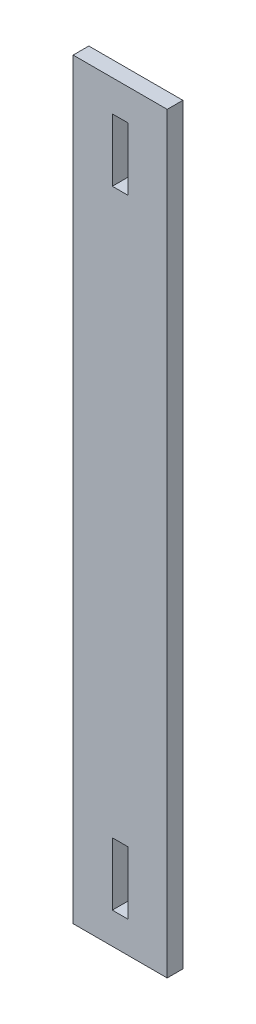
ISO-10303-21;
HEADER;
FILE_DESCRIPTION(('STEP AP214'),'2;1');
FILE_NAME('part.step','',(''),(''),'','','');
FILE_SCHEMA(('AUTOMOTIVE_DESIGN { 1 0 10303 214 1 1 1 1 }'));
ENDSEC;
DATA;
#1=APPLICATION_CONTEXT('core data for automotive mechanical design processes');
#2=APPLICATION_PROTOCOL_DEFINITION('international standard','automotive_design',2000,#1);
#3=PRODUCT_CONTEXT('',#1,'mechanical');
#4=PRODUCT('Part','Part','',(#3));
#5=PRODUCT_RELATED_PRODUCT_CATEGORY('part','',(#4));
#6=PRODUCT_DEFINITION_FORMATION('','',#4);
#7=PRODUCT_DEFINITION_CONTEXT('part definition',#1,'design');
#8=PRODUCT_DEFINITION('design','',#6,#7);
#9=PRODUCT_DEFINITION_SHAPE('','',#8);
#10=(LENGTH_UNIT() NAMED_UNIT(*) SI_UNIT(.MILLI.,.METRE.));
#11=(NAMED_UNIT(*) PLANE_ANGLE_UNIT() SI_UNIT($,.RADIAN.));
#12=(NAMED_UNIT(*) SI_UNIT($,.STERADIAN.) SOLID_ANGLE_UNIT());
#13=UNCERTAINTY_MEASURE_WITH_UNIT(LENGTH_MEASURE(1.E-05),#10,'distance_accuracy_value','');
#14=(GEOMETRIC_REPRESENTATION_CONTEXT(3) GLOBAL_UNCERTAINTY_ASSIGNED_CONTEXT((#13)) GLOBAL_UNIT_ASSIGNED_CONTEXT((#10,
#11,#12)) REPRESENTATION_CONTEXT('',''));
#15=CARTESIAN_POINT('',(0.,0.,0.));
#16=DIRECTION('',(0.,0.,1.));
#17=DIRECTION('',(1.,0.,0.));
#18=AXIS2_PLACEMENT_3D('',#15,#16,#17);
#19=CARTESIAN_POINT('',(0.,0.,6.35));
#20=DIRECTION('',(0.,0.,-1.));
#21=DIRECTION('',(-1.,0.,0.));
#22=AXIS2_PLACEMENT_3D('',#19,#20,#21);
#23=PLANE('',#22);
#24=DIRECTION('',(0.,1.,0.));
#25=VECTOR('',#24,1.);
#26=CARTESIAN_POINT('',(19.05,-152.4,6.35));
#27=LINE('',#26,#25);
#28=CARTESIAN_POINT('',(19.05,-152.4,6.35));
#29=VERTEX_POINT('',#28);
#30=CARTESIAN_POINT('',(19.05,152.4,6.35));
#31=VERTEX_POINT('',#30);
#32=EDGE_CURVE('E193',#29,#31,#27,.T.);
#33=ORIENTED_EDGE('',*,*,#32,.T.);
#34=DIRECTION('',(-1.,0.,0.));
#35=VECTOR('',#34,1.);
#36=CARTESIAN_POINT('',(-19.05,152.4,6.35));
#37=LINE('',#36,#35);
#38=CARTESIAN_POINT('',(-19.05,152.4,6.35));
#39=VERTEX_POINT('',#38);
#40=EDGE_CURVE('E197',#31,#39,#37,.T.);
#41=ORIENTED_EDGE('',*,*,#40,.T.);
#42=DIRECTION('',(0.,-1.,0.));
#43=VECTOR('',#42,1.);
#44=CARTESIAN_POINT('',(-19.05,-152.4,6.35));
#45=LINE('',#44,#43);
#46=CARTESIAN_POINT('',(-19.05,-152.4,6.35));
#47=VERTEX_POINT('',#46);
#48=EDGE_CURVE('E200',#39,#47,#45,.T.);
#49=ORIENTED_EDGE('',*,*,#48,.T.);
#50=DIRECTION('',(1.,0.,0.));
#51=VECTOR('',#50,1.);
#52=CARTESIAN_POINT('',(-19.05,-152.4,6.35));
#53=LINE('',#52,#51);
#54=EDGE_CURVE('E202',#47,#29,#53,.T.);
#55=ORIENTED_EDGE('',*,*,#54,.T.);
#56=EDGE_LOOP('',(#33,#41,#49,#55));
#57=FACE_BOUND('',#56,.T.);
#58=DIRECTION('',(-1.,0.,0.));
#59=VECTOR('',#58,1.);
#60=CARTESIAN_POINT('',(-3.175,139.7,6.35));
#61=LINE('',#60,#59);
#62=CARTESIAN_POINT('',(3.175,139.7,6.35));
#63=VERTEX_POINT('',#62);
#64=CARTESIAN_POINT('',(-3.175,139.7,6.35));
#65=VERTEX_POINT('',#64);
#66=EDGE_CURVE('E176',#63,#65,#61,.T.);
#67=ORIENTED_EDGE('',*,*,#66,.F.);
#68=DIRECTION('',(0.,1.,0.));
#69=VECTOR('',#68,1.);
#70=CARTESIAN_POINT('',(3.175,114.3,6.35));
#71=LINE('',#70,#69);
#72=CARTESIAN_POINT('',(3.175,114.3,6.35));
#73=VERTEX_POINT('',#72);
#74=EDGE_CURVE('E157',#73,#63,#71,.T.);
#75=ORIENTED_EDGE('',*,*,#74,.F.);
#76=DIRECTION('',(1.,0.,0.));
#77=VECTOR('',#76,1.);
#78=CARTESIAN_POINT('',(-3.175,114.3,6.35));
#79=LINE('',#78,#77);
#80=CARTESIAN_POINT('',(-3.175,114.3,6.35));
#81=VERTEX_POINT('',#80);
#82=EDGE_CURVE('E165',#81,#73,#79,.T.);
#83=ORIENTED_EDGE('',*,*,#82,.F.);
#84=DIRECTION('',(0.,-1.,0.));
#85=VECTOR('',#84,1.);
#86=CARTESIAN_POINT('',(-3.175,114.3,6.35));
#87=LINE('',#86,#85);
#88=EDGE_CURVE('E179',#65,#81,#87,.T.);
#89=ORIENTED_EDGE('',*,*,#88,.F.);
#90=EDGE_LOOP('',(#67,#75,#83,#89));
#91=FACE_BOUND('',#90,.T.);
#92=DIRECTION('',(0.,-1.,0.));
#93=VECTOR('',#92,1.);
#94=CARTESIAN_POINT('',(3.175,-114.3,6.35));
#95=LINE('',#94,#93);
#96=CARTESIAN_POINT('',(3.175,-114.3,6.35));
#97=VERTEX_POINT('',#96);
#98=CARTESIAN_POINT('',(3.175,-139.7,6.35));
#99=VERTEX_POINT('',#98);
#100=EDGE_CURVE('E52',#97,#99,#95,.T.);
#101=ORIENTED_EDGE('',*,*,#100,.T.);
#102=DIRECTION('',(-1.,0.,0.));
#103=VECTOR('',#102,1.);
#104=CARTESIAN_POINT('',(-3.175,-139.7,6.35));
#105=LINE('',#104,#103);
#106=CARTESIAN_POINT('',(-3.175,-139.7,6.35));
#107=VERTEX_POINT('',#106);
#108=EDGE_CURVE('E142',#99,#107,#105,.T.);
#109=ORIENTED_EDGE('',*,*,#108,.T.);
#110=DIRECTION('',(0.,1.,0.));
#111=VECTOR('',#110,1.);
#112=CARTESIAN_POINT('',(-3.175,-114.3,6.35));
#113=LINE('',#112,#111);
#114=CARTESIAN_POINT('',(-3.175,-114.3,6.35));
#115=VERTEX_POINT('',#114);
#116=EDGE_CURVE('E145',#107,#115,#113,.T.);
#117=ORIENTED_EDGE('',*,*,#116,.T.);
#118=DIRECTION('',(1.,0.,0.));
#119=VECTOR('',#118,1.);
#120=CARTESIAN_POINT('',(-3.175,-114.3,6.35));
#121=LINE('',#120,#119);
#122=EDGE_CURVE('E151',#115,#97,#121,.T.);
#123=ORIENTED_EDGE('',*,*,#122,.T.);
#124=EDGE_LOOP('',(#101,#109,#117,#123));
#125=FACE_BOUND('',#124,.T.);
#126=ADVANCED_FACE('F37',(#57,#91,#125),#23,.F.);
#127=CARTESIAN_POINT('',(0.,0.,0.));
#128=DIRECTION('',(0.,0.,-1.));
#129=DIRECTION('',(-1.,0.,0.));
#130=AXIS2_PLACEMENT_3D('',#127,#128,#129);
#131=PLANE('',#130);
#132=DIRECTION('',(0.,1.,0.));
#133=VECTOR('',#132,1.);
#134=CARTESIAN_POINT('',(19.05,-152.4,0.));
#135=LINE('',#134,#133);
#136=CARTESIAN_POINT('',(19.05,-152.4,0.));
#137=VERTEX_POINT('',#136);
#138=CARTESIAN_POINT('',(19.05,152.4,0.));
#139=VERTEX_POINT('',#138);
#140=EDGE_CURVE('E186',#137,#139,#135,.T.);
#141=ORIENTED_EDGE('',*,*,#140,.F.);
#142=DIRECTION('',(1.,0.,0.));
#143=VECTOR('',#142,1.);
#144=CARTESIAN_POINT('',(-19.05,-152.4,0.));
#145=LINE('',#144,#143);
#146=CARTESIAN_POINT('',(-19.05,-152.4,0.));
#147=VERTEX_POINT('',#146);
#148=EDGE_CURVE('E198',#147,#137,#145,.T.);
#149=ORIENTED_EDGE('',*,*,#148,.F.);
#150=DIRECTION('',(0.,-1.,0.));
#151=VECTOR('',#150,1.);
#152=CARTESIAN_POINT('',(-19.05,-152.4,0.));
#153=LINE('',#152,#151);
#154=CARTESIAN_POINT('',(-19.05,152.4,0.));
#155=VERTEX_POINT('',#154);
#156=EDGE_CURVE('E210',#155,#147,#153,.T.);
#157=ORIENTED_EDGE('',*,*,#156,.F.);
#158=DIRECTION('',(-1.,0.,0.));
#159=VECTOR('',#158,1.);
#160=CARTESIAN_POINT('',(-19.05,152.4,0.));
#161=LINE('',#160,#159);
#162=EDGE_CURVE('E208',#139,#155,#161,.T.);
#163=ORIENTED_EDGE('',*,*,#162,.F.);
#164=EDGE_LOOP('',(#141,#149,#157,#163));
#165=FACE_BOUND('',#164,.T.);
#166=DIRECTION('',(0.,1.,0.));
#167=VECTOR('',#166,1.);
#168=CARTESIAN_POINT('',(3.175,114.3,0.));
#169=LINE('',#168,#167);
#170=CARTESIAN_POINT('',(3.175,114.3,0.));
#171=VERTEX_POINT('',#170);
#172=CARTESIAN_POINT('',(3.175,139.7,0.));
#173=VERTEX_POINT('',#172);
#174=EDGE_CURVE('E161',#171,#173,#169,.T.);
#175=ORIENTED_EDGE('',*,*,#174,.T.);
#176=DIRECTION('',(-1.,0.,0.));
#177=VECTOR('',#176,1.);
#178=CARTESIAN_POINT('',(-3.175,139.7,0.));
#179=LINE('',#178,#177);
#180=CARTESIAN_POINT('',(-3.175,139.7,0.));
#181=VERTEX_POINT('',#180);
#182=EDGE_CURVE('E164',#173,#181,#179,.T.);
#183=ORIENTED_EDGE('',*,*,#182,.T.);
#184=DIRECTION('',(0.,-1.,0.));
#185=VECTOR('',#184,1.);
#186=CARTESIAN_POINT('',(-3.175,114.3,0.));
#187=LINE('',#186,#185);
#188=CARTESIAN_POINT('',(-3.175,114.3,0.));
#189=VERTEX_POINT('',#188);
#190=EDGE_CURVE('E168',#181,#189,#187,.T.);
#191=ORIENTED_EDGE('',*,*,#190,.T.);
#192=DIRECTION('',(1.,0.,0.));
#193=VECTOR('',#192,1.);
#194=CARTESIAN_POINT('',(-3.175,114.3,0.));
#195=LINE('',#194,#193);
#196=EDGE_CURVE('E171',#189,#171,#195,.T.);
#197=ORIENTED_EDGE('',*,*,#196,.T.);
#198=EDGE_LOOP('',(#175,#183,#191,#197));
#199=FACE_BOUND('',#198,.T.);
#200=DIRECTION('',(-1.,0.,0.));
#201=VECTOR('',#200,1.);
#202=CARTESIAN_POINT('',(-3.175,-139.7,0.));
#203=LINE('',#202,#201);
#204=CARTESIAN_POINT('',(3.175,-139.7,0.));
#205=VERTEX_POINT('',#204);
#206=CARTESIAN_POINT('',(-3.175,-139.7,0.));
#207=VERTEX_POINT('',#206);
#208=EDGE_CURVE('E138',#205,#207,#203,.T.);
#209=ORIENTED_EDGE('',*,*,#208,.F.);
#210=DIRECTION('',(0.,-1.,0.));
#211=VECTOR('',#210,1.);
#212=CARTESIAN_POINT('',(3.175,-114.3,0.));
#213=LINE('',#212,#211);
#214=CARTESIAN_POINT('',(3.175,-114.3,0.));
#215=VERTEX_POINT('',#214);
#216=EDGE_CURVE('E134',#215,#205,#213,.T.);
#217=ORIENTED_EDGE('',*,*,#216,.F.);
#218=DIRECTION('',(1.,0.,0.));
#219=VECTOR('',#218,1.);
#220=CARTESIAN_POINT('',(-3.175,-114.3,0.));
#221=LINE('',#220,#219);
#222=CARTESIAN_POINT('',(-3.175,-114.3,0.));
#223=VERTEX_POINT('',#222);
#224=EDGE_CURVE('E126',#223,#215,#221,.T.);
#225=ORIENTED_EDGE('',*,*,#224,.F.);
#226=DIRECTION('',(0.,1.,0.));
#227=VECTOR('',#226,1.);
#228=CARTESIAN_POINT('',(-3.175,-114.3,0.));
#229=LINE('',#228,#227);
#230=EDGE_CURVE('E133',#207,#223,#229,.T.);
#231=ORIENTED_EDGE('',*,*,#230,.F.);
#232=EDGE_LOOP('',(#209,#217,#225,#231));
#233=FACE_BOUND('',#232,.T.);
#234=ADVANCED_FACE('F141',(#165,#199,#233),#131,.T.);
#235=CARTESIAN_POINT('',(19.05,-152.4,6.35));
#236=DIRECTION('',(-1.,0.,0.));
#237=DIRECTION('',(0.,0.,1.));
#238=AXIS2_PLACEMENT_3D('',#235,#236,#237);
#239=PLANE('',#238);
#240=ORIENTED_EDGE('',*,*,#140,.T.);
#241=DIRECTION('',(0.,0.,-1.));
#242=VECTOR('',#241,1.);
#243=CARTESIAN_POINT('',(19.05,152.4,6.35));
#244=LINE('',#243,#242);
#245=EDGE_CURVE('E11',#31,#139,#244,.T.);
#246=ORIENTED_EDGE('',*,*,#245,.F.);
#247=ORIENTED_EDGE('',*,*,#32,.F.);
#248=DIRECTION('',(0.,0.,-1.));
#249=VECTOR('',#248,1.);
#250=CARTESIAN_POINT('',(19.05,-152.4,6.35));
#251=LINE('',#250,#249);
#252=EDGE_CURVE('E204',#29,#137,#251,.T.);
#253=ORIENTED_EDGE('',*,*,#252,.T.);
#254=EDGE_LOOP('',(#240,#246,#247,#253));
#255=FACE_BOUND('',#254,.T.);
#256=ADVANCED_FACE('F39',(#255),#239,.F.);
#257=CARTESIAN_POINT('',(-19.05,152.4,6.35));
#258=DIRECTION('',(0.,-1.,0.));
#259=DIRECTION('',(0.,0.,-1.));
#260=AXIS2_PLACEMENT_3D('',#257,#258,#259);
#261=PLANE('',#260);
#262=ORIENTED_EDGE('',*,*,#162,.T.);
#263=DIRECTION('',(0.,0.,-1.));
#264=VECTOR('',#263,1.);
#265=CARTESIAN_POINT('',(-19.05,152.4,6.35));
#266=LINE('',#265,#264);
#267=EDGE_CURVE('E45',#39,#155,#266,.T.);
#268=ORIENTED_EDGE('',*,*,#267,.F.);
#269=ORIENTED_EDGE('',*,*,#40,.F.);
#270=ORIENTED_EDGE('',*,*,#245,.T.);
#271=EDGE_LOOP('',(#262,#268,#269,#270));
#272=FACE_BOUND('',#271,.T.);
#273=ADVANCED_FACE('F238',(#272),#261,.F.);
#274=CARTESIAN_POINT('',(-19.05,-152.4,6.35));
#275=DIRECTION('',(1.,0.,0.));
#276=DIRECTION('',(0.,0.,-1.));
#277=AXIS2_PLACEMENT_3D('',#274,#275,#276);
#278=PLANE('',#277);
#279=ORIENTED_EDGE('',*,*,#156,.T.);
#280=DIRECTION('',(0.,0.,-1.));
#281=VECTOR('',#280,1.);
#282=CARTESIAN_POINT('',(-19.05,-152.4,6.35));
#283=LINE('',#282,#281);
#284=EDGE_CURVE('E215',#47,#147,#283,.T.);
#285=ORIENTED_EDGE('',*,*,#284,.F.);
#286=ORIENTED_EDGE('',*,*,#48,.F.);
#287=ORIENTED_EDGE('',*,*,#267,.T.);
#288=EDGE_LOOP('',(#279,#285,#286,#287));
#289=FACE_BOUND('',#288,.T.);
#290=ADVANCED_FACE('F222',(#289),#278,.F.);
#291=CARTESIAN_POINT('',(-19.05,-152.4,6.35));
#292=DIRECTION('',(0.,1.,0.));
#293=DIRECTION('',(0.,0.,1.));
#294=AXIS2_PLACEMENT_3D('',#291,#292,#293);
#295=PLANE('',#294);
#296=ORIENTED_EDGE('',*,*,#148,.T.);
#297=ORIENTED_EDGE('',*,*,#252,.F.);
#298=ORIENTED_EDGE('',*,*,#54,.F.);
#299=ORIENTED_EDGE('',*,*,#284,.T.);
#300=EDGE_LOOP('',(#296,#297,#298,#299));
#301=FACE_BOUND('',#300,.T.);
#302=ADVANCED_FACE('F231',(#301),#295,.F.);
#303=CARTESIAN_POINT('',(3.175,114.3,0.));
#304=DIRECTION('',(1.,0.,0.));
#305=DIRECTION('',(0.,0.,-1.));
#306=AXIS2_PLACEMENT_3D('',#303,#304,#305);
#307=PLANE('',#306);
#308=ORIENTED_EDGE('',*,*,#74,.T.);
#309=DIRECTION('',(0.,0.,1.));
#310=VECTOR('',#309,1.);
#311=CARTESIAN_POINT('',(3.175,139.7,0.));
#312=LINE('',#311,#310);
#313=EDGE_CURVE('E174',#173,#63,#312,.T.);
#314=ORIENTED_EDGE('',*,*,#313,.F.);
#315=ORIENTED_EDGE('',*,*,#174,.F.);
#316=DIRECTION('',(0.,0.,1.));
#317=VECTOR('',#316,1.);
#318=CARTESIAN_POINT('',(3.175,114.3,0.));
#319=LINE('',#318,#317);
#320=EDGE_CURVE('E184',#171,#73,#319,.T.);
#321=ORIENTED_EDGE('',*,*,#320,.T.);
#322=EDGE_LOOP('',(#308,#314,#315,#321));
#323=FACE_BOUND('',#322,.T.);
#324=ADVANCED_FACE('F252',(#323),#307,.F.);
#325=CARTESIAN_POINT('',(-3.175,114.3,0.));
#326=DIRECTION('',(0.,-1.,0.));
#327=DIRECTION('',(0.,0.,-1.));
#328=AXIS2_PLACEMENT_3D('',#325,#326,#327);
#329=PLANE('',#328);
#330=ORIENTED_EDGE('',*,*,#82,.T.);
#331=ORIENTED_EDGE('',*,*,#320,.F.);
#332=ORIENTED_EDGE('',*,*,#196,.F.);
#333=DIRECTION('',(0.,0.,1.));
#334=VECTOR('',#333,1.);
#335=CARTESIAN_POINT('',(-3.175,114.3,0.));
#336=LINE('',#335,#334);
#337=EDGE_CURVE('E187',#189,#81,#336,.T.);
#338=ORIENTED_EDGE('',*,*,#337,.T.);
#339=EDGE_LOOP('',(#330,#331,#332,#338));
#340=FACE_BOUND('',#339,.T.);
#341=ADVANCED_FACE('F259',(#340),#329,.F.);
#342=CARTESIAN_POINT('',(-3.175,114.3,0.));
#343=DIRECTION('',(-1.,0.,0.));
#344=DIRECTION('',(0.,0.,1.));
#345=AXIS2_PLACEMENT_3D('',#342,#343,#344);
#346=PLANE('',#345);
#347=ORIENTED_EDGE('',*,*,#88,.T.);
#348=ORIENTED_EDGE('',*,*,#337,.F.);
#349=ORIENTED_EDGE('',*,*,#190,.F.);
#350=DIRECTION('',(0.,0.,1.));
#351=VECTOR('',#350,1.);
#352=CARTESIAN_POINT('',(-3.175,139.7,0.));
#353=LINE('',#352,#351);
#354=EDGE_CURVE('E189',#181,#65,#353,.T.);
#355=ORIENTED_EDGE('',*,*,#354,.T.);
#356=EDGE_LOOP('',(#347,#348,#349,#355));
#357=FACE_BOUND('',#356,.T.);
#358=ADVANCED_FACE('F264',(#357),#346,.F.);
#359=CARTESIAN_POINT('',(-3.175,139.7,0.));
#360=DIRECTION('',(0.,1.,0.));
#361=DIRECTION('',(0.,0.,1.));
#362=AXIS2_PLACEMENT_3D('',#359,#360,#361);
#363=PLANE('',#362);
#364=ORIENTED_EDGE('',*,*,#66,.T.);
#365=ORIENTED_EDGE('',*,*,#354,.F.);
#366=ORIENTED_EDGE('',*,*,#182,.F.);
#367=ORIENTED_EDGE('',*,*,#313,.T.);
#368=EDGE_LOOP('',(#364,#365,#366,#367));
#369=FACE_BOUND('',#368,.T.);
#370=ADVANCED_FACE('F273',(#369),#363,.F.);
#371=CARTESIAN_POINT('',(3.175,-114.3,0.));
#372=DIRECTION('',(-1.,0.,0.));
#373=DIRECTION('',(0.,0.,1.));
#374=AXIS2_PLACEMENT_3D('',#371,#372,#373);
#375=PLANE('',#374);
#376=ORIENTED_EDGE('',*,*,#100,.F.);
#377=DIRECTION('',(0.,0.,1.));
#378=VECTOR('',#377,1.);
#379=CARTESIAN_POINT('',(3.175,-114.3,0.));
#380=LINE('',#379,#378);
#381=EDGE_CURVE('E128',#215,#97,#380,.T.);
#382=ORIENTED_EDGE('',*,*,#381,.F.);
#383=ORIENTED_EDGE('',*,*,#216,.T.);
#384=DIRECTION('',(0.,0.,1.));
#385=VECTOR('',#384,1.);
#386=CARTESIAN_POINT('',(3.175,-139.7,0.));
#387=LINE('',#386,#385);
#388=EDGE_CURVE('E155',#205,#99,#387,.T.);
#389=ORIENTED_EDGE('',*,*,#388,.T.);
#390=EDGE_LOOP('',(#376,#382,#383,#389));
#391=FACE_BOUND('',#390,.T.);
#392=ADVANCED_FACE('F136',(#391),#375,.T.);
#393=CARTESIAN_POINT('',(-3.175,-139.7,0.));
#394=DIRECTION('',(0.,1.,0.));
#395=DIRECTION('',(0.,0.,1.));
#396=AXIS2_PLACEMENT_3D('',#393,#394,#395);
#397=PLANE('',#396);
#398=ORIENTED_EDGE('',*,*,#108,.F.);
#399=ORIENTED_EDGE('',*,*,#388,.F.);
#400=ORIENTED_EDGE('',*,*,#208,.T.);
#401=DIRECTION('',(0.,0.,1.));
#402=VECTOR('',#401,1.);
#403=CARTESIAN_POINT('',(-3.175,-139.7,0.));
#404=LINE('',#403,#402);
#405=EDGE_CURVE('E158',#207,#107,#404,.T.);
#406=ORIENTED_EDGE('',*,*,#405,.T.);
#407=EDGE_LOOP('',(#398,#399,#400,#406));
#408=FACE_BOUND('',#407,.T.);
#409=ADVANCED_FACE('F287',(#408),#397,.T.);
#410=CARTESIAN_POINT('',(-3.175,-114.3,0.));
#411=DIRECTION('',(1.,0.,0.));
#412=DIRECTION('',(0.,0.,-1.));
#413=AXIS2_PLACEMENT_3D('',#410,#411,#412);
#414=PLANE('',#413);
#415=ORIENTED_EDGE('',*,*,#116,.F.);
#416=ORIENTED_EDGE('',*,*,#405,.F.);
#417=ORIENTED_EDGE('',*,*,#230,.T.);
#418=DIRECTION('',(0.,0.,1.));
#419=VECTOR('',#418,1.);
#420=CARTESIAN_POINT('',(-3.175,-114.3,0.));
#421=LINE('',#420,#419);
#422=EDGE_CURVE('E60',#223,#115,#421,.T.);
#423=ORIENTED_EDGE('',*,*,#422,.T.);
#424=EDGE_LOOP('',(#415,#416,#417,#423));
#425=FACE_BOUND('',#424,.T.);
#426=ADVANCED_FACE('F290',(#425),#414,.T.);
#427=CARTESIAN_POINT('',(-3.175,-114.3,0.));
#428=DIRECTION('',(0.,-1.,0.));
#429=DIRECTION('',(0.,0.,-1.));
#430=AXIS2_PLACEMENT_3D('',#427,#428,#429);
#431=PLANE('',#430);
#432=ORIENTED_EDGE('',*,*,#122,.F.);
#433=ORIENTED_EDGE('',*,*,#422,.F.);
#434=ORIENTED_EDGE('',*,*,#224,.T.);
#435=ORIENTED_EDGE('',*,*,#381,.T.);
#436=EDGE_LOOP('',(#432,#433,#434,#435));
#437=FACE_BOUND('',#436,.T.);
#438=ADVANCED_FACE('F127',(#437),#431,.T.);
#439=CLOSED_SHELL('',(#126,#234,#256,#273,#290,#302,#324,#341,#358,#370,#392,#409,#426,#438));
#440=MANIFOLD_SOLID_BREP('B2',#439);
#441=ADVANCED_BREP_SHAPE_REPRESENTATION('',(#18,#440),#14);
#442=SHAPE_DEFINITION_REPRESENTATION(#9,#441);
ENDSEC;
END-ISO-10303-21;
